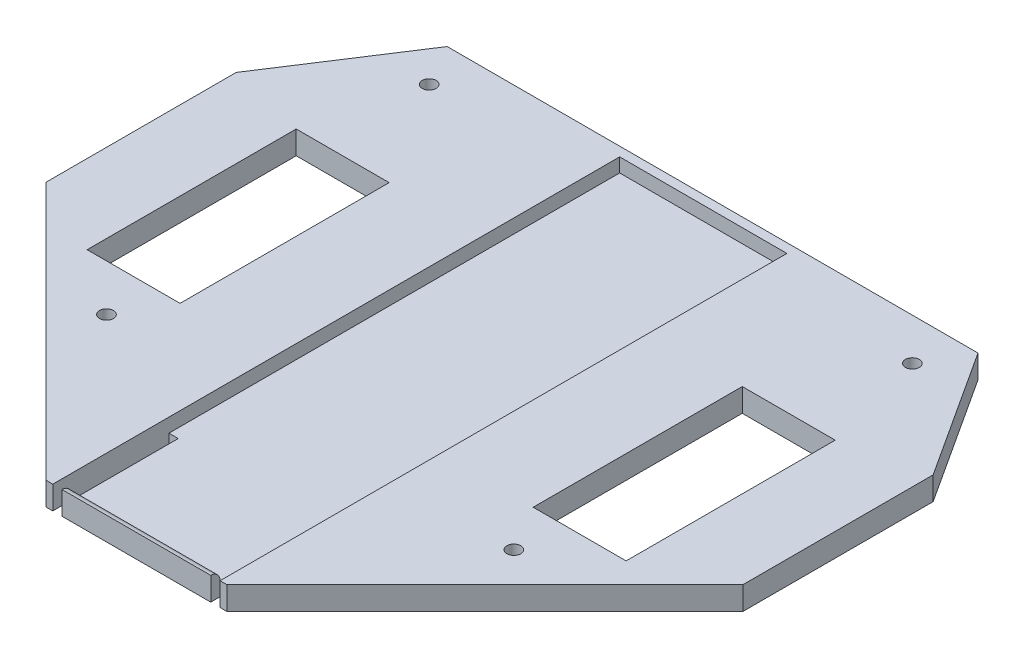
ISO-10303-21;
HEADER;
FILE_DESCRIPTION(('STEP AP214'),'2;1');
FILE_NAME('part.step','',(''),(''),'','','');
FILE_SCHEMA(('AUTOMOTIVE_DESIGN { 1 0 10303 214 1 1 1 1 }'));
ENDSEC;
DATA;
#1=APPLICATION_CONTEXT('core data for automotive mechanical design processes');
#2=APPLICATION_PROTOCOL_DEFINITION('international standard','automotive_design',2000,#1);
#3=PRODUCT_CONTEXT('',#1,'mechanical');
#4=PRODUCT('Part','Part','',(#3));
#5=PRODUCT_RELATED_PRODUCT_CATEGORY('part','',(#4));
#6=PRODUCT_DEFINITION_FORMATION('','',#4);
#7=PRODUCT_DEFINITION_CONTEXT('part definition',#1,'design');
#8=PRODUCT_DEFINITION('design','',#6,#7);
#9=PRODUCT_DEFINITION_SHAPE('','',#8);
#10=(LENGTH_UNIT() NAMED_UNIT(*) SI_UNIT(.MILLI.,.METRE.));
#11=(NAMED_UNIT(*) PLANE_ANGLE_UNIT() SI_UNIT($,.RADIAN.));
#12=(NAMED_UNIT(*) SI_UNIT($,.STERADIAN.) SOLID_ANGLE_UNIT());
#13=UNCERTAINTY_MEASURE_WITH_UNIT(LENGTH_MEASURE(1.E-05),#10,'distance_accuracy_value','');
#14=(GEOMETRIC_REPRESENTATION_CONTEXT(3) GLOBAL_UNCERTAINTY_ASSIGNED_CONTEXT((#13)) GLOBAL_UNIT_ASSIGNED_CONTEXT((#10,
#11,#12)) REPRESENTATION_CONTEXT('',''));
#15=CARTESIAN_POINT('',(0.,0.,0.));
#16=DIRECTION('',(0.,0.,1.));
#17=DIRECTION('',(1.,0.,0.));
#18=AXIS2_PLACEMENT_3D('',#15,#16,#17);
#19=CARTESIAN_POINT('',(0.,5.,0.));
#20=DIRECTION('',(0.,-1.,0.));
#21=DIRECTION('',(0.,0.,-1.));
#22=AXIS2_PLACEMENT_3D('',#19,#20,#21);
#23=PLANE('',#22);
#24=DIRECTION('',(0.,0.,1.));
#25=VECTOR('',#24,1.);
#26=CARTESIAN_POINT('',(110.,5.,22.61));
#27=LINE('',#26,#25);
#28=CARTESIAN_POINT('',(110.,5.00000000000001,22.61));
#29=VERTEX_POINT('',#28);
#30=CARTESIAN_POINT('',(110.,5.,67.61));
#31=VERTEX_POINT('',#30);
#32=EDGE_CURVE('E275',#29,#31,#27,.T.);
#33=ORIENTED_EDGE('',*,*,#32,.T.);
#34=DIRECTION('',(-1.,0.,0.));
#35=VECTOR('',#34,1.);
#36=CARTESIAN_POINT('',(110.,5.,67.61));
#37=LINE('',#36,#35);
#38=CARTESIAN_POINT('',(90.,5.,67.61));
#39=VERTEX_POINT('',#38);
#40=EDGE_CURVE('E279',#31,#39,#37,.T.);
#41=ORIENTED_EDGE('',*,*,#40,.T.);
#42=DIRECTION('',(0.,0.,-1.));
#43=VECTOR('',#42,1.);
#44=CARTESIAN_POINT('',(90.,5.,22.61));
#45=LINE('',#44,#43);
#46=CARTESIAN_POINT('',(90.,5.,22.61));
#47=VERTEX_POINT('',#46);
#48=EDGE_CURVE('E292',#39,#47,#45,.T.);
#49=ORIENTED_EDGE('',*,*,#48,.T.);
#50=DIRECTION('',(1.,0.,0.));
#51=VECTOR('',#50,1.);
#52=CARTESIAN_POINT('',(110.,5.,22.61));
#53=LINE('',#52,#51);
#54=EDGE_CURVE('E289',#47,#29,#53,.T.);
#55=ORIENTED_EDGE('',*,*,#54,.T.);
#56=EDGE_LOOP('',(#33,#41,#49,#55));
#57=FACE_BOUND('',#56,.T.);
#58=DIRECTION('',(1.,0.,0.));
#59=VECTOR('',#58,1.);
#60=CARTESIAN_POINT('',(-5.99999999999999,5.,67.61));
#61=LINE('',#60,#59);
#62=CARTESIAN_POINT('',(-5.99999999999999,5.00000000000002,67.61));
#63=VERTEX_POINT('',#62);
#64=CARTESIAN_POINT('',(14.,5.,67.61));
#65=VERTEX_POINT('',#64);
#66=EDGE_CURVE('E322',#63,#65,#61,.T.);
#67=ORIENTED_EDGE('',*,*,#66,.F.);
#68=DIRECTION('',(0.,0.,1.));
#69=VECTOR('',#68,1.);
#70=CARTESIAN_POINT('',(-6.,5.,22.61));
#71=LINE('',#70,#69);
#72=CARTESIAN_POINT('',(-6.,5.,22.61));
#73=VERTEX_POINT('',#72);
#74=EDGE_CURVE('E300',#73,#63,#71,.T.);
#75=ORIENTED_EDGE('',*,*,#74,.F.);
#76=DIRECTION('',(-1.,0.,0.));
#77=VECTOR('',#76,1.);
#78=CARTESIAN_POINT('',(-6.,5.,22.61));
#79=LINE('',#78,#77);
#80=CARTESIAN_POINT('',(14.,5.,22.61));
#81=VERTEX_POINT('',#80);
#82=EDGE_CURVE('E311',#81,#73,#79,.T.);
#83=ORIENTED_EDGE('',*,*,#82,.F.);
#84=DIRECTION('',(0.,0.,-1.));
#85=VECTOR('',#84,1.);
#86=CARTESIAN_POINT('',(14.,5.,22.61));
#87=LINE('',#86,#85);
#88=EDGE_CURVE('E325',#65,#81,#87,.T.);
#89=ORIENTED_EDGE('',*,*,#88,.F.);
#90=EDGE_LOOP('',(#67,#75,#83,#89));
#91=FACE_BOUND('',#90,.T.);
#92=CARTESIAN_POINT('',(95.8412408671324,5.,77.61));
#93=DIRECTION('',(0.,1.,0.));
#94=DIRECTION('',(0.,0.,1.));
#95=AXIS2_PLACEMENT_3D('',#92,#93,#94);
#96=CIRCLE('',#95,1.49999999999999);
#97=CARTESIAN_POINT('',(95.8412408671324,5.,79.11));
#98=VERTEX_POINT('',#97);
#99=EDGE_CURVE('E358',#98,#98,#96,.T.);
#100=ORIENTED_EDGE('',*,*,#99,.F.);
#101=EDGE_LOOP('',(#100));
#102=FACE_BOUND('',#101,.T.);
#103=CARTESIAN_POINT('',(8.16000000000001,5.,77.61));
#104=DIRECTION('',(0.,1.,0.));
#105=DIRECTION('',(0.,0.,1.));
#106=AXIS2_PLACEMENT_3D('',#103,#104,#105);
#107=CIRCLE('',#106,1.49999999999999);
#108=CARTESIAN_POINT('',(8.16000000000001,5.,79.11));
#109=VERTEX_POINT('',#108);
#110=EDGE_CURVE('E364',#109,#109,#107,.T.);
#111=ORIENTED_EDGE('',*,*,#110,.F.);
#112=EDGE_LOOP('',(#111));
#113=FACE_BOUND('',#112,.T.);
#114=CARTESIAN_POINT('',(103.998195646183,5.,0.00175939550289021));
#115=DIRECTION('',(0.,1.,0.));
#116=DIRECTION('',(0.,0.,1.));
#117=AXIS2_PLACEMENT_3D('',#114,#115,#116);
#118=CIRCLE('',#117,1.49999999999999);
#119=CARTESIAN_POINT('',(103.998195646183,5.,1.50175939550288));
#120=VERTEX_POINT('',#119);
#121=EDGE_CURVE('E368',#120,#120,#118,.T.);
#122=ORIENTED_EDGE('',*,*,#121,.F.);
#123=EDGE_LOOP('',(#122));
#124=FACE_BOUND('',#123,.T.);
#125=CARTESIAN_POINT('',(0.0030452209498836,5.,0.00175939550285707));
#126=DIRECTION('',(0.,1.,0.));
#127=DIRECTION('',(0.,0.,1.));
#128=AXIS2_PLACEMENT_3D('',#125,#126,#127);
#129=CIRCLE('',#128,1.49999999999999);
#130=CARTESIAN_POINT('',(0.0030452209498836,5.,1.50175939550285));
#131=VERTEX_POINT('',#130);
#132=EDGE_CURVE('E372',#131,#131,#129,.T.);
#133=ORIENTED_EDGE('',*,*,#132,.F.);
#134=EDGE_LOOP('',(#133));
#135=FACE_BOUND('',#134,.T.);
#136=DIRECTION('',(0.,0.,-1.));
#137=VECTOR('',#136,1.);
#138=CARTESIAN_POINT('',(70.,5.,-6.99824060449716));
#139=LINE('',#138,#137);
#140=CARTESIAN_POINT('',(70.,5.,115.001759395503));
#141=VERTEX_POINT('',#140);
#142=CARTESIAN_POINT('',(70.,5.,-6.99824060449716));
#143=VERTEX_POINT('',#142);
#144=EDGE_CURVE('E352',#141,#143,#139,.T.);
#145=ORIENTED_EDGE('',*,*,#144,.F.);
#146=DIRECTION('',(1.,0.,0.));
#147=VECTOR('',#146,1.);
#148=CARTESIAN_POINT('',(32.5409946216702,5.00000000000003,115.001759395503));
#149=LINE('',#148,#147);
#150=CARTESIAN_POINT('',(71.4602462454622,5.00000000000003,115.001759395503));
#151=VERTEX_POINT('',#150);
#152=EDGE_CURVE('E391',#141,#151,#149,.T.);
#153=ORIENTED_EDGE('',*,*,#152,.T.);
#154=DIRECTION('',(0.707106781186544,0.,-0.707106781186551));
#155=VECTOR('',#154,1.);
#156=CARTESIAN_POINT('',(127.,5.00000000000001,59.4620056409644));
#157=LINE('',#156,#155);
#158=CARTESIAN_POINT('',(127.,5.00000000000001,59.4620056409644));
#159=VERTEX_POINT('',#158);
#160=EDGE_CURVE('E395',#151,#159,#157,.T.);
#161=ORIENTED_EDGE('',*,*,#160,.T.);
#162=DIRECTION('',(0.,0.,-1.));
#163=VECTOR('',#162,1.);
#164=CARTESIAN_POINT('',(127.,5.00000000000001,59.4620056409644));
#165=LINE('',#164,#163);
#166=CARTESIAN_POINT('',(127.,5.,18.529510203719));
#167=VERTEX_POINT('',#166);
#168=EDGE_CURVE('E398',#159,#167,#165,.T.);
#169=ORIENTED_EDGE('',*,*,#168,.T.);
#170=DIRECTION('',(-0.544639035015021,0.,-0.838670567945428));
#171=VECTOR('',#170,1.);
#172=CARTESIAN_POINT('',(109.123269601496,5.,-8.99824060449713));
#173=LINE('',#172,#171);
#174=CARTESIAN_POINT('',(109.123269601496,5.,-8.99824060449713));
#175=VERTEX_POINT('',#174);
#176=EDGE_CURVE('E379',#167,#175,#173,.T.);
#177=ORIENTED_EDGE('',*,*,#176,.T.);
#178=DIRECTION('',(-1.,0.,0.));
#179=VECTOR('',#178,1.);
#180=CARTESIAN_POINT('',(-5.12202873436341,5.,-8.99824060449711));
#181=LINE('',#180,#179);
#182=CARTESIAN_POINT('',(-5.12202873436341,5.,-8.99824060449711));
#183=VERTEX_POINT('',#182);
#184=EDGE_CURVE('E382',#175,#183,#181,.T.);
#185=ORIENTED_EDGE('',*,*,#184,.T.);
#186=DIRECTION('',(-0.544639035015022,0.,0.838670567945427));
#187=VECTOR('',#186,1.);
#188=CARTESIAN_POINT('',(-5.12202873436341,5.,-8.99824060449711));
#189=LINE('',#188,#187);
#190=CARTESIAN_POINT('',(-23.,5.,18.5314209715409));
#191=VERTEX_POINT('',#190);
#192=EDGE_CURVE('E385',#183,#191,#189,.T.);
#193=ORIENTED_EDGE('',*,*,#192,.T.);
#194=DIRECTION('',(0.,0.,1.));
#195=VECTOR('',#194,1.);
#196=CARTESIAN_POINT('',(-23.,5.00000000000001,59.4607647738321));
#197=LINE('',#196,#195);
#198=CARTESIAN_POINT('',(-23.,5.00000000000001,59.4607647738321));
#199=VERTEX_POINT('',#198);
#200=EDGE_CURVE('E387',#191,#199,#197,.T.);
#201=ORIENTED_EDGE('',*,*,#200,.T.);
#202=DIRECTION('',(0.707106781186544,0.,0.707106781186551));
#203=VECTOR('',#202,1.);
#204=CARTESIAN_POINT('',(32.5409946216702,5.00000000000003,115.001759395503));
#205=LINE('',#204,#203);
#206=CARTESIAN_POINT('',(32.5409946216702,5.00000000000003,115.001759395503));
#207=VERTEX_POINT('',#206);
#208=EDGE_CURVE('E389',#199,#207,#205,.T.);
#209=ORIENTED_EDGE('',*,*,#208,.T.);
#210=CARTESIAN_POINT('',(34.,5.,115.001759395503));
#211=VERTEX_POINT('',#210);
#212=EDGE_CURVE('E392',#207,#211,#149,.T.);
#213=ORIENTED_EDGE('',*,*,#212,.T.);
#214=DIRECTION('',(0.,0.,1.));
#215=VECTOR('',#214,1.);
#216=CARTESIAN_POINT('',(34.,5.,-6.99824060449716));
#217=LINE('',#216,#215);
#218=CARTESIAN_POINT('',(34.,5.,-6.99824060449716));
#219=VERTEX_POINT('',#218);
#220=EDGE_CURVE('E332',#219,#211,#217,.T.);
#221=ORIENTED_EDGE('',*,*,#220,.F.);
#222=DIRECTION('',(-1.,0.,0.));
#223=VECTOR('',#222,1.);
#224=CARTESIAN_POINT('',(34.,5.,-6.99824060449716));
#225=LINE('',#224,#223);
#226=EDGE_CURVE('E343',#143,#219,#225,.T.);
#227=ORIENTED_EDGE('',*,*,#226,.F.);
#228=EDGE_LOOP('',(#145,#153,#161,#169,#177,#185,#193,#201,#209,#213,#221,#227));
#229=FACE_BOUND('',#228,.T.);
#230=ADVANCED_FACE('F33',(#57,#91,#102,#113,#124,#135,#229),#23,.F.);
#231=CARTESIAN_POINT('',(32.5409946216702,5.00000000000003,115.001759395503));
#232=DIRECTION('',(0.,0.,-1.));
#233=DIRECTION('',(-1.,0.,0.));
#234=AXIS2_PLACEMENT_3D('',#231,#232,#233);
#235=PLANE('',#234);
#236=ORIENTED_EDGE('',*,*,#152,.F.);
#237=DIRECTION('',(0.,1.,0.));
#238=VECTOR('',#237,1.);
#239=CARTESIAN_POINT('',(70.,0.,115.001759395503));
#240=LINE('',#239,#238);
#241=CARTESIAN_POINT('',(70.,0.,115.001759395503));
#242=VERTEX_POINT('',#241);
#243=EDGE_CURVE('E245',#242,#141,#240,.T.);
#244=ORIENTED_EDGE('',*,*,#243,.F.);
#245=DIRECTION('',(1.,0.,0.));
#246=VECTOR('',#245,1.);
#247=CARTESIAN_POINT('',(32.5409946216702,0.,115.001759395503));
#248=LINE('',#247,#246);
#249=CARTESIAN_POINT('',(71.4602462454622,0.,115.001759395503));
#250=VERTEX_POINT('',#249);
#251=EDGE_CURVE('E241',#242,#250,#248,.T.);
#252=ORIENTED_EDGE('',*,*,#251,.T.);
#253=DIRECTION('',(0.,-1.,0.));
#254=VECTOR('',#253,1.);
#255=CARTESIAN_POINT('',(71.4602462454622,5.00000000000003,115.001759395503));
#256=LINE('',#255,#254);
#257=EDGE_CURVE('E423',#151,#250,#256,.T.);
#258=ORIENTED_EDGE('',*,*,#257,.F.);
#259=EDGE_LOOP('',(#236,#244,#252,#258));
#260=FACE_BOUND('',#259,.T.);
#261=ADVANCED_FACE('F473',(#260),#235,.F.);
#262=CARTESIAN_POINT('',(32.5409946216702,0.,115.001759395503));
#263=VERTEX_POINT('',#262);
#264=CARTESIAN_POINT('',(34.,0.,115.001759395503));
#265=VERTEX_POINT('',#264);
#266=EDGE_CURVE('E411',#263,#265,#248,.T.);
#267=ORIENTED_EDGE('',*,*,#266,.T.);
#268=DIRECTION('',(0.,1.,0.));
#269=VECTOR('',#268,1.);
#270=CARTESIAN_POINT('',(34.,0.,115.001759395503));
#271=LINE('',#270,#269);
#272=EDGE_CURVE('E262',#265,#211,#271,.T.);
#273=ORIENTED_EDGE('',*,*,#272,.T.);
#274=ORIENTED_EDGE('',*,*,#212,.F.);
#275=DIRECTION('',(0.,-1.,0.));
#276=VECTOR('',#275,1.);
#277=CARTESIAN_POINT('',(32.5409946216702,5.00000000000003,115.001759395503));
#278=LINE('',#277,#276);
#279=EDGE_CURVE('E426',#207,#263,#278,.T.);
#280=ORIENTED_EDGE('',*,*,#279,.T.);
#281=EDGE_LOOP('',(#267,#273,#274,#280));
#282=FACE_BOUND('',#281,.T.);
#283=ADVANCED_FACE('F507',(#282),#235,.F.);
#284=CARTESIAN_POINT('',(0.,0.,0.));
#285=DIRECTION('',(0.,-1.,0.));
#286=DIRECTION('',(0.,0.,-1.));
#287=AXIS2_PLACEMENT_3D('',#284,#285,#286);
#288=PLANE('',#287);
#289=DIRECTION('',(0.,0.,-1.));
#290=VECTOR('',#289,1.);
#291=CARTESIAN_POINT('',(70.,0.,90.0017593955028));
#292=LINE('',#291,#290);
#293=CARTESIAN_POINT('',(70.,0.,90.0017593955028));
#294=VERTEX_POINT('',#293);
#295=EDGE_CURVE('E220',#242,#294,#292,.T.);
#296=ORIENTED_EDGE('',*,*,#295,.T.);
#297=DIRECTION('',(-1.,0.,0.));
#298=VECTOR('',#297,1.);
#299=CARTESIAN_POINT('',(70.,0.,90.0017593955028));
#300=LINE('',#299,#298);
#301=CARTESIAN_POINT('',(68.,0.,90.0017593955028));
#302=VERTEX_POINT('',#301);
#303=EDGE_CURVE('E230',#294,#302,#300,.T.);
#304=ORIENTED_EDGE('',*,*,#303,.T.);
#305=DIRECTION('',(0.,0.,1.));
#306=VECTOR('',#305,1.);
#307=CARTESIAN_POINT('',(68.,0.,90.0017593955028));
#308=LINE('',#307,#306);
#309=CARTESIAN_POINT('',(68.,0.,115.001759395503));
#310=VERTEX_POINT('',#309);
#311=EDGE_CURVE('E227',#302,#310,#308,.T.);
#312=ORIENTED_EDGE('',*,*,#311,.T.);
#313=CARTESIAN_POINT('',(36.,0.,115.001759395503));
#314=VERTEX_POINT('',#313);
#315=EDGE_CURVE('E415',#314,#310,#248,.T.);
#316=ORIENTED_EDGE('',*,*,#315,.F.);
#317=DIRECTION('',(0.,0.,-1.));
#318=VECTOR('',#317,1.);
#319=CARTESIAN_POINT('',(36.,0.,90.0017593955028));
#320=LINE('',#319,#318);
#321=CARTESIAN_POINT('',(36.,0.,90.0017593955028));
#322=VERTEX_POINT('',#321);
#323=EDGE_CURVE('E256',#314,#322,#320,.T.);
#324=ORIENTED_EDGE('',*,*,#323,.T.);
#325=DIRECTION('',(-1.,0.,0.));
#326=VECTOR('',#325,1.);
#327=CARTESIAN_POINT('',(34.,0.,90.0017593955028));
#328=LINE('',#327,#326);
#329=CARTESIAN_POINT('',(34.,0.,90.0017593955028));
#330=VERTEX_POINT('',#329);
#331=EDGE_CURVE('E259',#322,#330,#328,.T.);
#332=ORIENTED_EDGE('',*,*,#331,.T.);
#333=DIRECTION('',(0.,0.,1.));
#334=VECTOR('',#333,1.);
#335=CARTESIAN_POINT('',(34.,0.,90.0017593955028));
#336=LINE('',#335,#334);
#337=EDGE_CURVE('E253',#330,#265,#336,.T.);
#338=ORIENTED_EDGE('',*,*,#337,.T.);
#339=ORIENTED_EDGE('',*,*,#266,.F.);
#340=DIRECTION('',(0.707106781186544,0.,0.707106781186551));
#341=VECTOR('',#340,1.);
#342=CARTESIAN_POINT('',(32.5409946216702,0.,115.001759395503));
#343=LINE('',#342,#341);
#344=CARTESIAN_POINT('',(-23.,0.,59.4607647738321));
#345=VERTEX_POINT('',#344);
#346=EDGE_CURVE('E409',#345,#263,#343,.T.);
#347=ORIENTED_EDGE('',*,*,#346,.F.);
#348=DIRECTION('',(0.,0.,1.));
#349=VECTOR('',#348,1.);
#350=CARTESIAN_POINT('',(-23.,0.,59.4607647738321));
#351=LINE('',#350,#349);
#352=CARTESIAN_POINT('',(-23.,0.,18.5314209715409));
#353=VERTEX_POINT('',#352);
#354=EDGE_CURVE('E407',#353,#345,#351,.T.);
#355=ORIENTED_EDGE('',*,*,#354,.F.);
#356=DIRECTION('',(-0.544639035015022,0.,0.838670567945427));
#357=VECTOR('',#356,1.);
#358=CARTESIAN_POINT('',(-5.12202873436341,0.,-8.99824060449711));
#359=LINE('',#358,#357);
#360=CARTESIAN_POINT('',(-5.12202873436341,0.,-8.99824060449711));
#361=VERTEX_POINT('',#360);
#362=EDGE_CURVE('E405',#361,#353,#359,.T.);
#363=ORIENTED_EDGE('',*,*,#362,.F.);
#364=DIRECTION('',(-1.,0.,0.));
#365=VECTOR('',#364,1.);
#366=CARTESIAN_POINT('',(-5.12202873436341,0.,-8.99824060449711));
#367=LINE('',#366,#365);
#368=CARTESIAN_POINT('',(109.123269601496,0.,-8.99824060449713));
#369=VERTEX_POINT('',#368);
#370=EDGE_CURVE('E403',#369,#361,#367,.T.);
#371=ORIENTED_EDGE('',*,*,#370,.F.);
#372=DIRECTION('',(-0.544639035015021,0.,-0.838670567945428));
#373=VECTOR('',#372,1.);
#374=CARTESIAN_POINT('',(109.123269601496,0.,-8.99824060449713));
#375=LINE('',#374,#373);
#376=CARTESIAN_POINT('',(127.,0.,18.529510203719));
#377=VERTEX_POINT('',#376);
#378=EDGE_CURVE('E378',#377,#369,#375,.T.);
#379=ORIENTED_EDGE('',*,*,#378,.F.);
#380=DIRECTION('',(0.,0.,-1.));
#381=VECTOR('',#380,1.);
#382=CARTESIAN_POINT('',(127.,0.,59.4620056409644));
#383=LINE('',#382,#381);
#384=CARTESIAN_POINT('',(127.,0.,59.4620056409644));
#385=VERTEX_POINT('',#384);
#386=EDGE_CURVE('E383',#385,#377,#383,.T.);
#387=ORIENTED_EDGE('',*,*,#386,.F.);
#388=DIRECTION('',(0.707106781186544,0.,-0.707106781186551));
#389=VECTOR('',#388,1.);
#390=CARTESIAN_POINT('',(127.,0.,59.4620056409644));
#391=LINE('',#390,#389);
#392=EDGE_CURVE('E414',#250,#385,#391,.T.);
#393=ORIENTED_EDGE('',*,*,#392,.F.);
#394=ORIENTED_EDGE('',*,*,#251,.F.);
#395=EDGE_LOOP('',(#296,#304,#312,#316,#324,#332,#338,#339,#347,#355,#363,#371,#379,#387,#393,#394));
#396=FACE_BOUND('',#395,.T.);
#397=CARTESIAN_POINT('',(0.0030452209498836,0.,0.00175939550285707));
#398=DIRECTION('',(0.,-1.,0.));
#399=DIRECTION('',(0.,0.,-1.));
#400=AXIS2_PLACEMENT_3D('',#397,#398,#399);
#401=CIRCLE('',#400,1.49999999999999);
#402=CARTESIAN_POINT('',(0.0030452209498836,0.,-1.49824060449713));
#403=VERTEX_POINT('',#402);
#404=EDGE_CURVE('E375',#403,#403,#401,.T.);
#405=ORIENTED_EDGE('',*,*,#404,.F.);
#406=EDGE_LOOP('',(#405));
#407=FACE_BOUND('',#406,.T.);
#408=CARTESIAN_POINT('',(103.998195646183,0.,0.00175939550289021));
#409=DIRECTION('',(0.,-1.,0.));
#410=DIRECTION('',(0.,0.,-1.));
#411=AXIS2_PLACEMENT_3D('',#408,#409,#410);
#412=CIRCLE('',#411,1.49999999999999);
#413=CARTESIAN_POINT('',(103.998195646183,0.,-1.4982406044971));
#414=VERTEX_POINT('',#413);
#415=EDGE_CURVE('E371',#414,#414,#412,.T.);
#416=ORIENTED_EDGE('',*,*,#415,.F.);
#417=EDGE_LOOP('',(#416));
#418=FACE_BOUND('',#417,.T.);
#419=CARTESIAN_POINT('',(8.16000000000001,0.,77.61));
#420=DIRECTION('',(0.,-1.,0.));
#421=DIRECTION('',(0.,0.,-1.));
#422=AXIS2_PLACEMENT_3D('',#419,#420,#421);
#423=CIRCLE('',#422,1.49999999999999);
#424=CARTESIAN_POINT('',(8.16000000000001,0.,76.11));
#425=VERTEX_POINT('',#424);
#426=EDGE_CURVE('E367',#425,#425,#423,.T.);
#427=ORIENTED_EDGE('',*,*,#426,.F.);
#428=EDGE_LOOP('',(#427));
#429=FACE_BOUND('',#428,.T.);
#430=CARTESIAN_POINT('',(95.8412408671324,0.,77.61));
#431=DIRECTION('',(0.,-1.,0.));
#432=DIRECTION('',(0.,0.,-1.));
#433=AXIS2_PLACEMENT_3D('',#430,#431,#432);
#434=CIRCLE('',#433,1.49999999999999);
#435=CARTESIAN_POINT('',(95.8412408671324,0.,76.1100000000001));
#436=VERTEX_POINT('',#435);
#437=EDGE_CURVE('E363',#436,#436,#434,.T.);
#438=ORIENTED_EDGE('',*,*,#437,.F.);
#439=EDGE_LOOP('',(#438));
#440=FACE_BOUND('',#439,.T.);
#441=DIRECTION('',(0.,0.,1.));
#442=VECTOR('',#441,1.);
#443=CARTESIAN_POINT('',(-6.,0.,22.61));
#444=LINE('',#443,#442);
#445=CARTESIAN_POINT('',(-6.,0.,22.61));
#446=VERTEX_POINT('',#445);
#447=CARTESIAN_POINT('',(-5.99999999999999,0.,67.61));
#448=VERTEX_POINT('',#447);
#449=EDGE_CURVE('E307',#446,#448,#444,.T.);
#450=ORIENTED_EDGE('',*,*,#449,.T.);
#451=DIRECTION('',(1.,0.,0.));
#452=VECTOR('',#451,1.);
#453=CARTESIAN_POINT('',(-5.99999999999999,0.,67.61));
#454=LINE('',#453,#452);
#455=CARTESIAN_POINT('',(14.,0.,67.61));
#456=VERTEX_POINT('',#455);
#457=EDGE_CURVE('E310',#448,#456,#454,.T.);
#458=ORIENTED_EDGE('',*,*,#457,.T.);
#459=DIRECTION('',(0.,0.,-1.));
#460=VECTOR('',#459,1.);
#461=CARTESIAN_POINT('',(14.,0.,22.61));
#462=LINE('',#461,#460);
#463=CARTESIAN_POINT('',(14.,0.,22.61));
#464=VERTEX_POINT('',#463);
#465=EDGE_CURVE('E314',#456,#464,#462,.T.);
#466=ORIENTED_EDGE('',*,*,#465,.T.);
#467=DIRECTION('',(-1.,0.,0.));
#468=VECTOR('',#467,1.);
#469=CARTESIAN_POINT('',(-6.,0.,22.61));
#470=LINE('',#469,#468);
#471=EDGE_CURVE('E317',#464,#446,#470,.T.);
#472=ORIENTED_EDGE('',*,*,#471,.T.);
#473=EDGE_LOOP('',(#450,#458,#466,#472));
#474=FACE_BOUND('',#473,.T.);
#475=DIRECTION('',(-1.,0.,0.));
#476=VECTOR('',#475,1.);
#477=CARTESIAN_POINT('',(110.,0.,67.61));
#478=LINE('',#477,#476);
#479=CARTESIAN_POINT('',(110.,0.,67.61));
#480=VERTEX_POINT('',#479);
#481=CARTESIAN_POINT('',(90.,0.,67.61));
#482=VERTEX_POINT('',#481);
#483=EDGE_CURVE('E284',#480,#482,#478,.T.);
#484=ORIENTED_EDGE('',*,*,#483,.F.);
#485=DIRECTION('',(0.,0.,1.));
#486=VECTOR('',#485,1.);
#487=CARTESIAN_POINT('',(110.,0.,22.61));
#488=LINE('',#487,#486);
#489=CARTESIAN_POINT('',(110.,0.,22.61));
#490=VERTEX_POINT('',#489);
#491=EDGE_CURVE('E276',#490,#480,#488,.T.);
#492=ORIENTED_EDGE('',*,*,#491,.F.);
#493=DIRECTION('',(1.,0.,0.));
#494=VECTOR('',#493,1.);
#495=CARTESIAN_POINT('',(110.,0.,22.61));
#496=LINE('',#495,#494);
#497=CARTESIAN_POINT('',(90.,0.,22.61));
#498=VERTEX_POINT('',#497);
#499=EDGE_CURVE('E278',#498,#490,#496,.T.);
#500=ORIENTED_EDGE('',*,*,#499,.F.);
#501=DIRECTION('',(0.,0.,-1.));
#502=VECTOR('',#501,1.);
#503=CARTESIAN_POINT('',(90.,0.,22.61));
#504=LINE('',#503,#502);
#505=EDGE_CURVE('E281',#482,#498,#504,.T.);
#506=ORIENTED_EDGE('',*,*,#505,.F.);
#507=EDGE_LOOP('',(#484,#492,#500,#506));
#508=FACE_BOUND('',#507,.T.);
#509=ADVANCED_FACE('F238',(#396,#407,#418,#429,#440,#474,#508),#288,.T.);
#510=CARTESIAN_POINT('',(109.123269601496,5.,-8.99824060449713));
#511=DIRECTION('',(-0.838670567945428,0.,0.544639035015021));
#512=DIRECTION('',(0.544639035015021,0.,0.838670567945428));
#513=AXIS2_PLACEMENT_3D('',#510,#511,#512);
#514=PLANE('',#513);
#515=ORIENTED_EDGE('',*,*,#378,.T.);
#516=DIRECTION('',(0.,-1.,0.));
#517=VECTOR('',#516,1.);
#518=CARTESIAN_POINT('',(109.123269601496,5.,-8.99824060449713));
#519=LINE('',#518,#517);
#520=EDGE_CURVE('E438',#175,#369,#519,.T.);
#521=ORIENTED_EDGE('',*,*,#520,.F.);
#522=ORIENTED_EDGE('',*,*,#176,.F.);
#523=DIRECTION('',(0.,-1.,0.));
#524=VECTOR('',#523,1.);
#525=CARTESIAN_POINT('',(127.,5.,18.529510203719));
#526=LINE('',#525,#524);
#527=EDGE_CURVE('E400',#167,#377,#526,.T.);
#528=ORIENTED_EDGE('',*,*,#527,.T.);
#529=EDGE_LOOP('',(#515,#521,#522,#528));
#530=FACE_BOUND('',#529,.T.);
#531=ADVANCED_FACE('F485',(#530),#514,.F.);
#532=CARTESIAN_POINT('',(-5.12202873436341,5.,-8.99824060449711));
#533=DIRECTION('',(0.,0.,1.));
#534=DIRECTION('',(0.,-1.,0.));
#535=AXIS2_PLACEMENT_3D('',#532,#533,#534);
#536=PLANE('',#535);
#537=ORIENTED_EDGE('',*,*,#370,.T.);
#538=DIRECTION('',(0.,-1.,0.));
#539=VECTOR('',#538,1.);
#540=CARTESIAN_POINT('',(-5.12202873436341,5.,-8.99824060449711));
#541=LINE('',#540,#539);
#542=EDGE_CURVE('E435',#183,#361,#541,.T.);
#543=ORIENTED_EDGE('',*,*,#542,.F.);
#544=ORIENTED_EDGE('',*,*,#184,.F.);
#545=ORIENTED_EDGE('',*,*,#520,.T.);
#546=EDGE_LOOP('',(#537,#543,#544,#545));
#547=FACE_BOUND('',#546,.T.);
#548=ADVANCED_FACE('F488',(#547),#536,.F.);
#549=CARTESIAN_POINT('',(-5.12202873436341,5.,-8.99824060449711));
#550=DIRECTION('',(0.838670567945427,0.,0.544639035015022));
#551=DIRECTION('',(0.544639035015022,0.,-0.838670567945427));
#552=AXIS2_PLACEMENT_3D('',#549,#550,#551);
#553=PLANE('',#552);
#554=ORIENTED_EDGE('',*,*,#362,.T.);
#555=DIRECTION('',(0.,-1.,0.));
#556=VECTOR('',#555,1.);
#557=CARTESIAN_POINT('',(-23.,5.,18.5314209715409));
#558=LINE('',#557,#556);
#559=EDGE_CURVE('E432',#191,#353,#558,.T.);
#560=ORIENTED_EDGE('',*,*,#559,.F.);
#561=ORIENTED_EDGE('',*,*,#192,.F.);
#562=ORIENTED_EDGE('',*,*,#542,.T.);
#563=EDGE_LOOP('',(#554,#560,#561,#562));
#564=FACE_BOUND('',#563,.T.);
#565=ADVANCED_FACE('F493',(#564),#553,.F.);
#566=CARTESIAN_POINT('',(-23.,5.00000000000001,59.4607647738321));
#567=DIRECTION('',(1.,0.,0.));
#568=DIRECTION('',(0.,0.,-1.));
#569=AXIS2_PLACEMENT_3D('',#566,#567,#568);
#570=PLANE('',#569);
#571=ORIENTED_EDGE('',*,*,#354,.T.);
#572=DIRECTION('',(0.,-1.,0.));
#573=VECTOR('',#572,1.);
#574=CARTESIAN_POINT('',(-23.,5.00000000000001,59.4607647738321));
#575=LINE('',#574,#573);
#576=EDGE_CURVE('E429',#199,#345,#575,.T.);
#577=ORIENTED_EDGE('',*,*,#576,.F.);
#578=ORIENTED_EDGE('',*,*,#200,.F.);
#579=ORIENTED_EDGE('',*,*,#559,.T.);
#580=EDGE_LOOP('',(#571,#577,#578,#579));
#581=FACE_BOUND('',#580,.T.);
#582=ADVANCED_FACE('F499',(#581),#570,.F.);
#583=CARTESIAN_POINT('',(32.5409946216702,5.00000000000003,115.001759395503));
#584=DIRECTION('',(0.707106781186551,0.,-0.707106781186544));
#585=DIRECTION('',(-0.707106781186544,0.,-0.707106781186551));
#586=AXIS2_PLACEMENT_3D('',#583,#584,#585);
#587=PLANE('',#586);
#588=ORIENTED_EDGE('',*,*,#346,.T.);
#589=ORIENTED_EDGE('',*,*,#279,.F.);
#590=ORIENTED_EDGE('',*,*,#208,.F.);
#591=ORIENTED_EDGE('',*,*,#576,.T.);
#592=EDGE_LOOP('',(#588,#589,#590,#591));
#593=FACE_BOUND('',#592,.T.);
#594=ADVANCED_FACE('F503',(#593),#587,.F.);
#595=ORIENTED_EDGE('',*,*,#315,.T.);
#596=DIRECTION('',(0.,1.,0.));
#597=VECTOR('',#596,1.);
#598=CARTESIAN_POINT('',(68.,0.,115.001759395503));
#599=LINE('',#598,#597);
#600=CARTESIAN_POINT('',(68.,5.,115.001759395503));
#601=VERTEX_POINT('',#600);
#602=EDGE_CURVE('E248',#310,#601,#599,.T.);
#603=ORIENTED_EDGE('',*,*,#602,.T.);
#604=CARTESIAN_POINT('',(36.,5.,115.001759395503));
#605=VERTEX_POINT('',#604);
#606=EDGE_CURVE('E396',#605,#601,#149,.T.);
#607=ORIENTED_EDGE('',*,*,#606,.F.);
#608=DIRECTION('',(0.,1.,0.));
#609=VECTOR('',#608,1.);
#610=CARTESIAN_POINT('',(36.,0.,115.001759395503));
#611=LINE('',#610,#609);
#612=EDGE_CURVE('E270',#314,#605,#611,.T.);
#613=ORIENTED_EDGE('',*,*,#612,.F.);
#614=EDGE_LOOP('',(#595,#603,#607,#613));
#615=FACE_BOUND('',#614,.T.);
#616=ADVANCED_FACE('F463',(#615),#235,.F.);
#617=CARTESIAN_POINT('',(127.,5.00000000000001,59.4620056409644));
#618=DIRECTION('',(-0.707106781186551,0.,-0.707106781186544));
#619=DIRECTION('',(-0.707106781186544,0.,0.707106781186551));
#620=AXIS2_PLACEMENT_3D('',#617,#618,#619);
#621=PLANE('',#620);
#622=ORIENTED_EDGE('',*,*,#392,.T.);
#623=DIRECTION('',(0.,-1.,0.));
#624=VECTOR('',#623,1.);
#625=CARTESIAN_POINT('',(127.,5.00000000000001,59.4620056409644));
#626=LINE('',#625,#624);
#627=EDGE_CURVE('E420',#159,#385,#626,.T.);
#628=ORIENTED_EDGE('',*,*,#627,.F.);
#629=ORIENTED_EDGE('',*,*,#160,.F.);
#630=ORIENTED_EDGE('',*,*,#257,.T.);
#631=EDGE_LOOP('',(#622,#628,#629,#630));
#632=FACE_BOUND('',#631,.T.);
#633=ADVANCED_FACE('F475',(#632),#621,.F.);
#634=CARTESIAN_POINT('',(127.,5.00000000000001,59.4620056409644));
#635=DIRECTION('',(-1.,0.,0.));
#636=DIRECTION('',(0.,0.,1.));
#637=AXIS2_PLACEMENT_3D('',#634,#635,#636);
#638=PLANE('',#637);
#639=ORIENTED_EDGE('',*,*,#386,.T.);
#640=ORIENTED_EDGE('',*,*,#527,.F.);
#641=ORIENTED_EDGE('',*,*,#168,.F.);
#642=ORIENTED_EDGE('',*,*,#627,.T.);
#643=EDGE_LOOP('',(#639,#640,#641,#642));
#644=FACE_BOUND('',#643,.T.);
#645=ADVANCED_FACE('F480',(#644),#638,.F.);
#646=CARTESIAN_POINT('',(0.0030452209498836,5.,0.00175939550285707));
#647=DIRECTION('',(0.,1.,0.));
#648=DIRECTION('',(0.,0.,1.));
#649=AXIS2_PLACEMENT_3D('',#646,#647,#648);
#650=CYLINDRICAL_SURFACE('',#649,1.49999999999999);
#651=ORIENTED_EDGE('',*,*,#404,.T.);
#652=EDGE_LOOP('',(#651));
#653=FACE_BOUND('',#652,.T.);
#654=ORIENTED_EDGE('',*,*,#132,.T.);
#655=EDGE_LOOP('',(#654));
#656=FACE_BOUND('',#655,.T.);
#657=ADVANCED_FACE('F548',(#653,#656),#650,.F.);
#658=CARTESIAN_POINT('',(103.998195646183,5.,0.00175939550289021));
#659=DIRECTION('',(0.,1.,0.));
#660=DIRECTION('',(0.,0.,1.));
#661=AXIS2_PLACEMENT_3D('',#658,#659,#660);
#662=CYLINDRICAL_SURFACE('',#661,1.49999999999999);
#663=ORIENTED_EDGE('',*,*,#415,.T.);
#664=EDGE_LOOP('',(#663));
#665=FACE_BOUND('',#664,.T.);
#666=ORIENTED_EDGE('',*,*,#121,.T.);
#667=EDGE_LOOP('',(#666));
#668=FACE_BOUND('',#667,.T.);
#669=ADVANCED_FACE('F605',(#665,#668),#662,.F.);
#670=CARTESIAN_POINT('',(8.16000000000001,5.,77.61));
#671=DIRECTION('',(0.,1.,0.));
#672=DIRECTION('',(0.,0.,1.));
#673=AXIS2_PLACEMENT_3D('',#670,#671,#672);
#674=CYLINDRICAL_SURFACE('',#673,1.49999999999999);
#675=ORIENTED_EDGE('',*,*,#426,.T.);
#676=EDGE_LOOP('',(#675));
#677=FACE_BOUND('',#676,.T.);
#678=ORIENTED_EDGE('',*,*,#110,.T.);
#679=EDGE_LOOP('',(#678));
#680=FACE_BOUND('',#679,.T.);
#681=ADVANCED_FACE('F612',(#677,#680),#674,.F.);
#682=CARTESIAN_POINT('',(95.8412408671324,5.,77.61));
#683=DIRECTION('',(0.,1.,0.));
#684=DIRECTION('',(0.,0.,1.));
#685=AXIS2_PLACEMENT_3D('',#682,#683,#684);
#686=CYLINDRICAL_SURFACE('',#685,1.49999999999999);
#687=ORIENTED_EDGE('',*,*,#437,.T.);
#688=EDGE_LOOP('',(#687));
#689=FACE_BOUND('',#688,.T.);
#690=ORIENTED_EDGE('',*,*,#99,.T.);
#691=EDGE_LOOP('',(#690));
#692=FACE_BOUND('',#691,.T.);
#693=ADVANCED_FACE('F619',(#689,#692),#686,.F.);
#694=CARTESIAN_POINT('',(34.,2.,-6.99824060449716));
#695=DIRECTION('',(-1.,0.,0.));
#696=DIRECTION('',(0.,0.,1.));
#697=AXIS2_PLACEMENT_3D('',#694,#695,#696);
#698=PLANE('',#697);
#699=ORIENTED_EDGE('',*,*,#220,.T.);
#700=ORIENTED_EDGE('',*,*,#272,.F.);
#701=ORIENTED_EDGE('',*,*,#337,.F.);
#702=DIRECTION('',(0.,1.,0.));
#703=VECTOR('',#702,1.);
#704=CARTESIAN_POINT('',(34.,0.,90.0017593955028));
#705=LINE('',#704,#703);
#706=CARTESIAN_POINT('',(34.,2.,90.0017593955028));
#707=VERTEX_POINT('',#706);
#708=EDGE_CURVE('E263',#330,#707,#705,.T.);
#709=ORIENTED_EDGE('',*,*,#708,.T.);
#710=DIRECTION('',(0.,0.,1.));
#711=VECTOR('',#710,1.);
#712=CARTESIAN_POINT('',(34.,2.,-6.99824060449716));
#713=LINE('',#712,#711);
#714=CARTESIAN_POINT('',(34.,2.,-6.99824060449716));
#715=VERTEX_POINT('',#714);
#716=EDGE_CURVE('E339',#715,#707,#713,.T.);
#717=ORIENTED_EDGE('',*,*,#716,.F.);
#718=DIRECTION('',(0.,1.,0.));
#719=VECTOR('',#718,1.);
#720=CARTESIAN_POINT('',(34.,2.,-6.99824060449716));
#721=LINE('',#720,#719);
#722=EDGE_CURVE('E356',#715,#219,#721,.T.);
#723=ORIENTED_EDGE('',*,*,#722,.T.);
#724=EDGE_LOOP('',(#699,#700,#701,#709,#717,#723));
#725=FACE_BOUND('',#724,.T.);
#726=ADVANCED_FACE('F510',(#725),#698,.F.);
#727=CARTESIAN_POINT('',(34.,2.,-6.99824060449716));
#728=DIRECTION('',(0.,0.,-1.));
#729=DIRECTION('',(-1.,0.,0.));
#730=AXIS2_PLACEMENT_3D('',#727,#728,#729);
#731=PLANE('',#730);
#732=ORIENTED_EDGE('',*,*,#226,.T.);
#733=ORIENTED_EDGE('',*,*,#722,.F.);
#734=DIRECTION('',(-1.,0.,0.));
#735=VECTOR('',#734,1.);
#736=CARTESIAN_POINT('',(34.,2.,-6.99824060449716));
#737=LINE('',#736,#735);
#738=CARTESIAN_POINT('',(70.,2.,-6.99824060449716));
#739=VERTEX_POINT('',#738);
#740=EDGE_CURVE('E347',#739,#715,#737,.T.);
#741=ORIENTED_EDGE('',*,*,#740,.F.);
#742=DIRECTION('',(0.,1.,0.));
#743=VECTOR('',#742,1.);
#744=CARTESIAN_POINT('',(70.,2.,-6.99824060449716));
#745=LINE('',#744,#743);
#746=EDGE_CURVE('E350',#739,#143,#745,.T.);
#747=ORIENTED_EDGE('',*,*,#746,.T.);
#748=EDGE_LOOP('',(#732,#733,#741,#747));
#749=FACE_BOUND('',#748,.T.);
#750=ADVANCED_FACE('F515',(#749),#731,.F.);
#751=CARTESIAN_POINT('',(70.,2.,-6.99824060449716));
#752=DIRECTION('',(1.,0.,0.));
#753=DIRECTION('',(0.,0.,-1.));
#754=AXIS2_PLACEMENT_3D('',#751,#752,#753);
#755=PLANE('',#754);
#756=DIRECTION('',(0.,0.,-1.));
#757=VECTOR('',#756,1.);
#758=CARTESIAN_POINT('',(70.,2.,-6.99824060449716));
#759=LINE('',#758,#757);
#760=CARTESIAN_POINT('',(70.,2.,90.0017593955028));
#761=VERTEX_POINT('',#760);
#762=EDGE_CURVE('E223',#761,#739,#759,.T.);
#763=ORIENTED_EDGE('',*,*,#762,.F.);
#764=DIRECTION('',(0.,1.,0.));
#765=VECTOR('',#764,1.);
#766=CARTESIAN_POINT('',(70.,0.,90.0017593955028));
#767=LINE('',#766,#765);
#768=EDGE_CURVE('E215',#294,#761,#767,.T.);
#769=ORIENTED_EDGE('',*,*,#768,.F.);
#770=ORIENTED_EDGE('',*,*,#295,.F.);
#771=ORIENTED_EDGE('',*,*,#243,.T.);
#772=ORIENTED_EDGE('',*,*,#144,.T.);
#773=ORIENTED_EDGE('',*,*,#746,.F.);
#774=EDGE_LOOP('',(#763,#769,#770,#771,#772,#773));
#775=FACE_BOUND('',#774,.T.);
#776=ADVANCED_FACE('F217',(#775),#755,.F.);
#777=CARTESIAN_POINT('',(34.,2.,113.001759395503));
#778=DIRECTION('',(0.,0.,1.));
#779=DIRECTION('',(1.,0.,0.));
#780=AXIS2_PLACEMENT_3D('',#777,#778,#779);
#781=PLANE('',#780);
#782=DIRECTION('',(0.,1.,0.));
#783=VECTOR('',#782,1.);
#784=CARTESIAN_POINT('',(36.,2.,113.001759395503));
#785=LINE('',#784,#783);
#786=CARTESIAN_POINT('',(36.,2.,113.001759395503));
#787=VERTEX_POINT('',#786);
#788=CARTESIAN_POINT('',(36.,3.00000000000003,113.001759395503));
#789=VERTEX_POINT('',#788);
#790=EDGE_CURVE('E266',#787,#789,#785,.T.);
#791=ORIENTED_EDGE('',*,*,#790,.T.);
#792=DIRECTION('',(1.,0.,0.));
#793=VECTOR('',#792,1.);
#794=CARTESIAN_POINT('',(34.,3.00000000000003,113.001759395503));
#795=LINE('',#794,#793);
#796=CARTESIAN_POINT('',(68.,3.00000000000003,113.001759395503));
#797=VERTEX_POINT('',#796);
#798=EDGE_CURVE('E456',#789,#797,#795,.T.);
#799=ORIENTED_EDGE('',*,*,#798,.T.);
#800=DIRECTION('',(0.,-1.,0.));
#801=VECTOR('',#800,1.);
#802=CARTESIAN_POINT('',(68.,2.,113.001759395503));
#803=LINE('',#802,#801);
#804=CARTESIAN_POINT('',(68.,2.,113.001759395503));
#805=VERTEX_POINT('',#804);
#806=EDGE_CURVE('E247',#797,#805,#803,.T.);
#807=ORIENTED_EDGE('',*,*,#806,.T.);
#808=DIRECTION('',(1.,0.,0.));
#809=VECTOR('',#808,1.);
#810=CARTESIAN_POINT('',(34.,2.,113.001759395503));
#811=LINE('',#810,#809);
#812=EDGE_CURVE('E342',#787,#805,#811,.T.);
#813=ORIENTED_EDGE('',*,*,#812,.F.);
#814=EDGE_LOOP('',(#791,#799,#807,#813));
#815=FACE_BOUND('',#814,.T.);
#816=ADVANCED_FACE('F527',(#815),#781,.F.);
#817=CARTESIAN_POINT('',(0.,2.,0.));
#818=DIRECTION('',(0.,1.,0.));
#819=DIRECTION('',(0.,0.,1.));
#820=AXIS2_PLACEMENT_3D('',#817,#818,#819);
#821=PLANE('',#820);
#822=DIRECTION('',(0.,0.,1.));
#823=VECTOR('',#822,1.);
#824=CARTESIAN_POINT('',(68.,2.,0.));
#825=LINE('',#824,#823);
#826=CARTESIAN_POINT('',(68.,2.,90.0017593955028));
#827=VERTEX_POINT('',#826);
#828=EDGE_CURVE('E453',#827,#805,#825,.T.);
#829=ORIENTED_EDGE('',*,*,#828,.F.);
#830=DIRECTION('',(-1.,0.,0.));
#831=VECTOR('',#830,1.);
#832=CARTESIAN_POINT('',(0.,2.,90.0017593955028));
#833=LINE('',#832,#831);
#834=EDGE_CURVE('E451',#761,#827,#833,.T.);
#835=ORIENTED_EDGE('',*,*,#834,.F.);
#836=ORIENTED_EDGE('',*,*,#762,.T.);
#837=ORIENTED_EDGE('',*,*,#740,.T.);
#838=ORIENTED_EDGE('',*,*,#716,.T.);
#839=DIRECTION('',(-1.,0.,0.));
#840=VECTOR('',#839,1.);
#841=CARTESIAN_POINT('',(0.,2.,90.0017593955028));
#842=LINE('',#841,#840);
#843=CARTESIAN_POINT('',(36.,2.,90.0017593955028));
#844=VERTEX_POINT('',#843);
#845=EDGE_CURVE('E449',#844,#707,#842,.T.);
#846=ORIENTED_EDGE('',*,*,#845,.F.);
#847=DIRECTION('',(0.,0.,-1.));
#848=VECTOR('',#847,1.);
#849=CARTESIAN_POINT('',(36.,2.,0.));
#850=LINE('',#849,#848);
#851=EDGE_CURVE('E441',#787,#844,#850,.T.);
#852=ORIENTED_EDGE('',*,*,#851,.F.);
#853=ORIENTED_EDGE('',*,*,#812,.T.);
#854=EDGE_LOOP('',(#829,#835,#836,#837,#838,#846,#852,#853));
#855=FACE_BOUND('',#854,.T.);
#856=ADVANCED_FACE('F518',(#855),#821,.T.);
#857=CARTESIAN_POINT('',(-6.,0.,22.61));
#858=DIRECTION('',(-1.,0.,0.));
#859=DIRECTION('',(0.,0.,1.));
#860=AXIS2_PLACEMENT_3D('',#857,#858,#859);
#861=PLANE('',#860);
#862=ORIENTED_EDGE('',*,*,#74,.T.);
#863=DIRECTION('',(0.,1.,0.));
#864=VECTOR('',#863,1.);
#865=CARTESIAN_POINT('',(-5.99999999999999,0.,67.61));
#866=LINE('',#865,#864);
#867=EDGE_CURVE('E320',#448,#63,#866,.T.);
#868=ORIENTED_EDGE('',*,*,#867,.F.);
#869=ORIENTED_EDGE('',*,*,#449,.F.);
#870=DIRECTION('',(0.,1.,0.));
#871=VECTOR('',#870,1.);
#872=CARTESIAN_POINT('',(-6.,0.,22.61));
#873=LINE('',#872,#871);
#874=EDGE_CURVE('E330',#446,#73,#873,.T.);
#875=ORIENTED_EDGE('',*,*,#874,.T.);
#876=EDGE_LOOP('',(#862,#868,#869,#875));
#877=FACE_BOUND('',#876,.T.);
#878=ADVANCED_FACE('F534',(#877),#861,.F.);
#879=CARTESIAN_POINT('',(-6.,0.,22.61));
#880=DIRECTION('',(0.,0.,-1.));
#881=DIRECTION('',(-1.,0.,0.));
#882=AXIS2_PLACEMENT_3D('',#879,#880,#881);
#883=PLANE('',#882);
#884=ORIENTED_EDGE('',*,*,#82,.T.);
#885=ORIENTED_EDGE('',*,*,#874,.F.);
#886=ORIENTED_EDGE('',*,*,#471,.F.);
#887=DIRECTION('',(0.,1.,0.));
#888=VECTOR('',#887,1.);
#889=CARTESIAN_POINT('',(14.,0.,22.61));
#890=LINE('',#889,#888);
#891=EDGE_CURVE('E333',#464,#81,#890,.T.);
#892=ORIENTED_EDGE('',*,*,#891,.T.);
#893=EDGE_LOOP('',(#884,#885,#886,#892));
#894=FACE_BOUND('',#893,.T.);
#895=ADVANCED_FACE('F802',(#894),#883,.F.);
#896=CARTESIAN_POINT('',(14.,0.,22.61));
#897=DIRECTION('',(1.,0.,0.));
#898=DIRECTION('',(0.,0.,-1.));
#899=AXIS2_PLACEMENT_3D('',#896,#897,#898);
#900=PLANE('',#899);
#901=ORIENTED_EDGE('',*,*,#88,.T.);
#902=ORIENTED_EDGE('',*,*,#891,.F.);
#903=ORIENTED_EDGE('',*,*,#465,.F.);
#904=DIRECTION('',(0.,1.,0.));
#905=VECTOR('',#904,1.);
#906=CARTESIAN_POINT('',(14.,0.,67.61));
#907=LINE('',#906,#905);
#908=EDGE_CURVE('E335',#456,#65,#907,.T.);
#909=ORIENTED_EDGE('',*,*,#908,.T.);
#910=EDGE_LOOP('',(#901,#902,#903,#909));
#911=FACE_BOUND('',#910,.T.);
#912=ADVANCED_FACE('F793',(#911),#900,.F.);
#913=CARTESIAN_POINT('',(-5.99999999999999,0.,67.61));
#914=DIRECTION('',(0.,0.,1.));
#915=DIRECTION('',(1.,0.,0.));
#916=AXIS2_PLACEMENT_3D('',#913,#914,#915);
#917=PLANE('',#916);
#918=ORIENTED_EDGE('',*,*,#66,.T.);
#919=ORIENTED_EDGE('',*,*,#908,.F.);
#920=ORIENTED_EDGE('',*,*,#457,.F.);
#921=ORIENTED_EDGE('',*,*,#867,.T.);
#922=EDGE_LOOP('',(#918,#919,#920,#921));
#923=FACE_BOUND('',#922,.T.);
#924=ADVANCED_FACE('F780',(#923),#917,.F.);
#925=CARTESIAN_POINT('',(110.,0.,22.61));
#926=DIRECTION('',(-1.,0.,0.));
#927=DIRECTION('',(0.,0.,1.));
#928=AXIS2_PLACEMENT_3D('',#925,#926,#927);
#929=PLANE('',#928);
#930=ORIENTED_EDGE('',*,*,#32,.F.);
#931=DIRECTION('',(0.,1.,0.));
#932=VECTOR('',#931,1.);
#933=CARTESIAN_POINT('',(110.,0.,22.61));
#934=LINE('',#933,#932);
#935=EDGE_CURVE('E286',#490,#29,#934,.T.);
#936=ORIENTED_EDGE('',*,*,#935,.F.);
#937=ORIENTED_EDGE('',*,*,#491,.T.);
#938=DIRECTION('',(0.,1.,0.));
#939=VECTOR('',#938,1.);
#940=CARTESIAN_POINT('',(110.,0.,67.61));
#941=LINE('',#940,#939);
#942=EDGE_CURVE('E297',#480,#31,#941,.T.);
#943=ORIENTED_EDGE('',*,*,#942,.T.);
#944=EDGE_LOOP('',(#930,#936,#937,#943));
#945=FACE_BOUND('',#944,.T.);
#946=ADVANCED_FACE('F771',(#945),#929,.T.);
#947=CARTESIAN_POINT('',(110.,0.,67.61));
#948=DIRECTION('',(0.,0.,-1.));
#949=DIRECTION('',(-1.,0.,0.));
#950=AXIS2_PLACEMENT_3D('',#947,#948,#949);
#951=PLANE('',#950);
#952=ORIENTED_EDGE('',*,*,#40,.F.);
#953=ORIENTED_EDGE('',*,*,#942,.F.);
#954=ORIENTED_EDGE('',*,*,#483,.T.);
#955=DIRECTION('',(0.,1.,0.));
#956=VECTOR('',#955,1.);
#957=CARTESIAN_POINT('',(90.,0.,67.61));
#958=LINE('',#957,#956);
#959=EDGE_CURVE('E301',#482,#39,#958,.T.);
#960=ORIENTED_EDGE('',*,*,#959,.T.);
#961=EDGE_LOOP('',(#952,#953,#954,#960));
#962=FACE_BOUND('',#961,.T.);
#963=ADVANCED_FACE('F762',(#962),#951,.T.);
#964=CARTESIAN_POINT('',(90.,0.,22.61));
#965=DIRECTION('',(1.,0.,0.));
#966=DIRECTION('',(0.,0.,-1.));
#967=AXIS2_PLACEMENT_3D('',#964,#965,#966);
#968=PLANE('',#967);
#969=ORIENTED_EDGE('',*,*,#48,.F.);
#970=ORIENTED_EDGE('',*,*,#959,.F.);
#971=ORIENTED_EDGE('',*,*,#505,.T.);
#972=DIRECTION('',(0.,1.,0.));
#973=VECTOR('',#972,1.);
#974=CARTESIAN_POINT('',(90.,0.,22.61));
#975=LINE('',#974,#973);
#976=EDGE_CURVE('E303',#498,#47,#975,.T.);
#977=ORIENTED_EDGE('',*,*,#976,.T.);
#978=EDGE_LOOP('',(#969,#970,#971,#977));
#979=FACE_BOUND('',#978,.T.);
#980=ADVANCED_FACE('F753',(#979),#968,.T.);
#981=CARTESIAN_POINT('',(110.,0.,22.61));
#982=DIRECTION('',(0.,0.,1.));
#983=DIRECTION('',(1.,0.,0.));
#984=AXIS2_PLACEMENT_3D('',#981,#982,#983);
#985=PLANE('',#984);
#986=ORIENTED_EDGE('',*,*,#54,.F.);
#987=ORIENTED_EDGE('',*,*,#976,.F.);
#988=ORIENTED_EDGE('',*,*,#499,.T.);
#989=ORIENTED_EDGE('',*,*,#935,.T.);
#990=EDGE_LOOP('',(#986,#987,#988,#989));
#991=FACE_BOUND('',#990,.T.);
#992=ADVANCED_FACE('F692',(#991),#985,.T.);
#993=CARTESIAN_POINT('',(36.,0.,90.0017593955028));
#994=DIRECTION('',(1.,0.,0.));
#995=DIRECTION('',(0.,0.,-1.));
#996=AXIS2_PLACEMENT_3D('',#993,#994,#995);
#997=PLANE('',#996);
#998=ORIENTED_EDGE('',*,*,#612,.T.);
#999=CARTESIAN_POINT('',(36.,3.00000000000003,115.001759395503));
#1000=DIRECTION('',(1.,0.,0.));
#1001=DIRECTION('',(0.,0.,-1.));
#1002=AXIS2_PLACEMENT_3D('',#999,#1000,#1001);
#1003=CIRCLE('',#1002,2.);
#1004=EDGE_CURVE('E11',#605,#789,#1003,.F.);
#1005=ORIENTED_EDGE('',*,*,#1004,.T.);
#1006=ORIENTED_EDGE('',*,*,#790,.F.);
#1007=ORIENTED_EDGE('',*,*,#851,.T.);
#1008=DIRECTION('',(0.,1.,0.));
#1009=VECTOR('',#1008,1.);
#1010=CARTESIAN_POINT('',(36.,0.,90.0017593955028));
#1011=LINE('',#1010,#1009);
#1012=EDGE_CURVE('E267',#322,#844,#1011,.T.);
#1013=ORIENTED_EDGE('',*,*,#1012,.F.);
#1014=ORIENTED_EDGE('',*,*,#323,.F.);
#1015=EDGE_LOOP('',(#998,#1005,#1006,#1007,#1013,#1014));
#1016=FACE_BOUND('',#1015,.T.);
#1017=ADVANCED_FACE('F521',(#1016),#997,.F.);
#1018=CARTESIAN_POINT('',(34.,0.,90.0017593955028));
#1019=DIRECTION('',(0.,0.,-1.));
#1020=DIRECTION('',(-1.,0.,0.));
#1021=AXIS2_PLACEMENT_3D('',#1018,#1019,#1020);
#1022=PLANE('',#1021);
#1023=ORIENTED_EDGE('',*,*,#845,.T.);
#1024=ORIENTED_EDGE('',*,*,#708,.F.);
#1025=ORIENTED_EDGE('',*,*,#331,.F.);
#1026=ORIENTED_EDGE('',*,*,#1012,.T.);
#1027=EDGE_LOOP('',(#1023,#1024,#1025,#1026));
#1028=FACE_BOUND('',#1027,.T.);
#1029=ADVANCED_FACE('F524',(#1028),#1022,.F.);
#1030=CARTESIAN_POINT('',(68.,0.,90.0017593955028));
#1031=DIRECTION('',(-1.,0.,0.));
#1032=DIRECTION('',(0.,0.,1.));
#1033=AXIS2_PLACEMENT_3D('',#1030,#1031,#1032);
#1034=PLANE('',#1033);
#1035=ORIENTED_EDGE('',*,*,#806,.F.);
#1036=CARTESIAN_POINT('',(68.,3.00000000000003,115.001759395503));
#1037=DIRECTION('',(-1.,0.,0.));
#1038=DIRECTION('',(0.,0.,1.));
#1039=AXIS2_PLACEMENT_3D('',#1036,#1037,#1038);
#1040=CIRCLE('',#1039,2.);
#1041=EDGE_CURVE('E41',#797,#601,#1040,.F.);
#1042=ORIENTED_EDGE('',*,*,#1041,.T.);
#1043=ORIENTED_EDGE('',*,*,#602,.F.);
#1044=ORIENTED_EDGE('',*,*,#311,.F.);
#1045=DIRECTION('',(0.,1.,0.));
#1046=VECTOR('',#1045,1.);
#1047=CARTESIAN_POINT('',(68.,0.,90.0017593955028));
#1048=LINE('',#1047,#1046);
#1049=EDGE_CURVE('E226',#302,#827,#1048,.T.);
#1050=ORIENTED_EDGE('',*,*,#1049,.T.);
#1051=ORIENTED_EDGE('',*,*,#828,.T.);
#1052=EDGE_LOOP('',(#1035,#1042,#1043,#1044,#1050,#1051));
#1053=FACE_BOUND('',#1052,.T.);
#1054=ADVANCED_FACE('F459',(#1053),#1034,.F.);
#1055=CARTESIAN_POINT('',(70.,0.,90.0017593955028));
#1056=DIRECTION('',(0.,0.,-1.));
#1057=DIRECTION('',(-1.,0.,0.));
#1058=AXIS2_PLACEMENT_3D('',#1055,#1056,#1057);
#1059=PLANE('',#1058);
#1060=ORIENTED_EDGE('',*,*,#834,.T.);
#1061=ORIENTED_EDGE('',*,*,#1049,.F.);
#1062=ORIENTED_EDGE('',*,*,#303,.F.);
#1063=ORIENTED_EDGE('',*,*,#768,.T.);
#1064=EDGE_LOOP('',(#1060,#1061,#1062,#1063));
#1065=FACE_BOUND('',#1064,.T.);
#1066=ADVANCED_FACE('F231',(#1065),#1059,.F.);
#1067=CARTESIAN_POINT('',(34.,3.00000000000003,115.001759395503));
#1068=DIRECTION('',(1.,0.,0.));
#1069=DIRECTION('',(0.,0.,-1.));
#1070=AXIS2_PLACEMENT_3D('',#1067,#1068,#1069);
#1071=CYLINDRICAL_SURFACE('',#1070,2.);
#1072=ORIENTED_EDGE('',*,*,#1004,.F.);
#1073=ORIENTED_EDGE('',*,*,#606,.T.);
#1074=ORIENTED_EDGE('',*,*,#1041,.F.);
#1075=ORIENTED_EDGE('',*,*,#798,.F.);
#1076=EDGE_LOOP('',(#1072,#1073,#1074,#1075));
#1077=FACE_BOUND('',#1076,.T.);
#1078=ADVANCED_FACE('F35',(#1077),#1071,.T.);
#1079=CLOSED_SHELL('',(#230,#261,#283,#509,#531,#548,#565,#582,#594,#616,#633,#645,#657,#669,
#681,#693,#726,#750,#776,#816,#856,#878,#895,#912,#924,#946,#963,#980,#992,#1017,#1029,#1054,
#1066,#1078));
#1080=MANIFOLD_SOLID_BREP('B2',#1079);
#1081=ADVANCED_BREP_SHAPE_REPRESENTATION('',(#18,#1080),#14);
#1082=SHAPE_DEFINITION_REPRESENTATION(#9,#1081);
ENDSEC;
END-ISO-10303-21;
